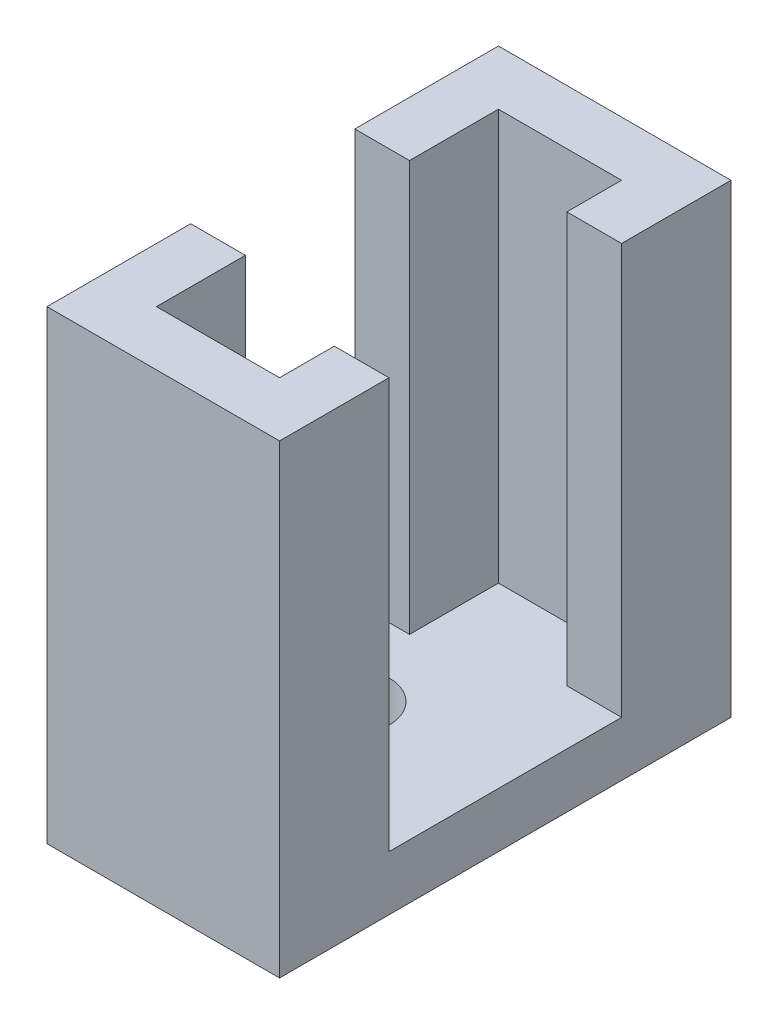
ISO-10303-21;
HEADER;
FILE_DESCRIPTION(('STEP AP214'),'2;1');
FILE_NAME('part.step','',(''),(''),'','','');
FILE_SCHEMA(('AUTOMOTIVE_DESIGN { 1 0 10303 214 1 1 1 1 }'));
ENDSEC;
DATA;
#1=APPLICATION_CONTEXT('core data for automotive mechanical design processes');
#2=APPLICATION_PROTOCOL_DEFINITION('international standard','automotive_design',2000,#1);
#3=PRODUCT_CONTEXT('',#1,'mechanical');
#4=PRODUCT('Part','Part','',(#3));
#5=PRODUCT_RELATED_PRODUCT_CATEGORY('part','',(#4));
#6=PRODUCT_DEFINITION_FORMATION('','',#4);
#7=PRODUCT_DEFINITION_CONTEXT('part definition',#1,'design');
#8=PRODUCT_DEFINITION('design','',#6,#7);
#9=PRODUCT_DEFINITION_SHAPE('','',#8);
#10=(LENGTH_UNIT() NAMED_UNIT(*) SI_UNIT(.MILLI.,.METRE.));
#11=(NAMED_UNIT(*) PLANE_ANGLE_UNIT() SI_UNIT($,.RADIAN.));
#12=(NAMED_UNIT(*) SI_UNIT($,.STERADIAN.) SOLID_ANGLE_UNIT());
#13=UNCERTAINTY_MEASURE_WITH_UNIT(LENGTH_MEASURE(1.E-05),#10,'distance_accuracy_value','');
#14=(GEOMETRIC_REPRESENTATION_CONTEXT(3) GLOBAL_UNCERTAINTY_ASSIGNED_CONTEXT((#13)) GLOBAL_UNIT_ASSIGNED_CONTEXT((#10,
#11,#12)) REPRESENTATION_CONTEXT('',''));
#15=CARTESIAN_POINT('',(0.,0.,0.));
#16=DIRECTION('',(0.,0.,1.));
#17=DIRECTION('',(1.,0.,0.));
#18=AXIS2_PLACEMENT_3D('',#15,#16,#17);
#19=CARTESIAN_POINT('',(-4.5,15.,0.));
#20=DIRECTION('',(-1.,0.,0.));
#21=DIRECTION('',(0.,0.,1.));
#22=AXIS2_PLACEMENT_3D('',#19,#20,#21);
#23=PLANE('',#22);
#24=DIRECTION('',(0.,0.,-1.));
#25=VECTOR('',#24,1.);
#26=CARTESIAN_POINT('',(-4.5,15.,0.));
#27=LINE('',#26,#25);
#28=CARTESIAN_POINT('',(-4.5,15.,3.25));
#29=VERTEX_POINT('',#28);
#30=CARTESIAN_POINT('',(-4.5,15.,0.));
#31=VERTEX_POINT('',#30);
#32=EDGE_CURVE('E53',#29,#31,#27,.T.);
#33=ORIENTED_EDGE('',*,*,#32,.F.);
#34=DIRECTION('',(0.,1.,0.));
#35=VECTOR('',#34,1.);
#36=CARTESIAN_POINT('',(-4.5,20.,3.25));
#37=LINE('',#36,#35);
#38=CARTESIAN_POINT('',(-4.5,0.,3.25));
#39=VERTEX_POINT('',#38);
#40=EDGE_CURVE('E180',#39,#29,#37,.T.);
#41=ORIENTED_EDGE('',*,*,#40,.F.);
#42=DIRECTION('',(0.,0.,-1.));
#43=VECTOR('',#42,1.);
#44=CARTESIAN_POINT('',(-4.5,0.,0.));
#45=LINE('',#44,#43);
#46=CARTESIAN_POINT('',(-4.5,0.,0.));
#47=VERTEX_POINT('',#46);
#48=EDGE_CURVE('E255',#39,#47,#45,.T.);
#49=ORIENTED_EDGE('',*,*,#48,.T.);
#50=DIRECTION('',(0.,-1.,0.));
#51=VECTOR('',#50,1.);
#52=CARTESIAN_POINT('',(-4.5,15.,0.));
#53=LINE('',#52,#51);
#54=EDGE_CURVE('E264',#31,#47,#53,.T.);
#55=ORIENTED_EDGE('',*,*,#54,.F.);
#56=EDGE_LOOP('',(#33,#41,#49,#55));
#57=FACE_BOUND('',#56,.T.);
#58=ADVANCED_FACE('F33',(#57),#23,.F.);
#59=CARTESIAN_POINT('',(0.,15.,0.));
#60=DIRECTION('',(0.,1.,0.));
#61=DIRECTION('',(0.,0.,1.));
#62=AXIS2_PLACEMENT_3D('',#59,#60,#61);
#63=PLANE('',#62);
#64=DIRECTION('',(-1.,0.,0.));
#65=VECTOR('',#64,1.);
#66=CARTESIAN_POINT('',(0.,15.,3.25));
#67=LINE('',#66,#65);
#68=CARTESIAN_POINT('',(-6.5,15.,3.25));
#69=VERTEX_POINT('',#68);
#70=EDGE_CURVE('E11',#29,#69,#67,.T.);
#71=ORIENTED_EDGE('',*,*,#70,.F.);
#72=ORIENTED_EDGE('',*,*,#32,.T.);
#73=DIRECTION('',(1.,0.,0.));
#74=VECTOR('',#73,1.);
#75=CARTESIAN_POINT('',(0.,15.,0.));
#76=LINE('',#75,#74);
#77=CARTESIAN_POINT('',(0.,15.,0.));
#78=VERTEX_POINT('',#77);
#79=EDGE_CURVE('E48',#31,#78,#76,.T.);
#80=ORIENTED_EDGE('',*,*,#79,.T.);
#81=DIRECTION('',(0.,0.,1.));
#82=VECTOR('',#81,1.);
#83=CARTESIAN_POINT('',(0.,15.,2.));
#84=LINE('',#83,#82);
#85=CARTESIAN_POINT('',(0.,15.,2.));
#86=VERTEX_POINT('',#85);
#87=EDGE_CURVE('E213',#78,#86,#84,.T.);
#88=ORIENTED_EDGE('',*,*,#87,.T.);
#89=DIRECTION('',(1.,0.,0.));
#90=VECTOR('',#89,1.);
#91=CARTESIAN_POINT('',(2.,15.,2.));
#92=LINE('',#91,#90);
#93=CARTESIAN_POINT('',(2.,15.,2.));
#94=VERTEX_POINT('',#93);
#95=EDGE_CURVE('E215',#86,#94,#92,.T.);
#96=ORIENTED_EDGE('',*,*,#95,.T.);
#97=DIRECTION('',(0.,0.,-1.));
#98=VECTOR('',#97,1.);
#99=CARTESIAN_POINT('',(2.,15.,-2.));
#100=LINE('',#99,#98);
#101=CARTESIAN_POINT('',(2.,15.,-2.));
#102=VERTEX_POINT('',#101);
#103=EDGE_CURVE('E218',#94,#102,#100,.T.);
#104=ORIENTED_EDGE('',*,*,#103,.T.);
#105=DIRECTION('',(-1.,0.,0.));
#106=VECTOR('',#105,1.);
#107=CARTESIAN_POINT('',(-6.5,15.,-2.));
#108=LINE('',#107,#106);
#109=CARTESIAN_POINT('',(-6.5,15.,-2.));
#110=VERTEX_POINT('',#109);
#111=EDGE_CURVE('E220',#102,#110,#108,.T.);
#112=ORIENTED_EDGE('',*,*,#111,.T.);
#113=DIRECTION('',(0.,0.,1.));
#114=VECTOR('',#113,1.);
#115=CARTESIAN_POINT('',(-6.5,15.,14.5));
#116=LINE('',#115,#114);
#117=EDGE_CURVE('E222',#110,#69,#116,.T.);
#118=ORIENTED_EDGE('',*,*,#117,.T.);
#119=EDGE_LOOP('',(#71,#72,#80,#88,#96,#104,#112,#118));
#120=FACE_BOUND('',#119,.T.);
#121=ADVANCED_FACE('F332',(#120),#63,.T.);
#122=CARTESIAN_POINT('',(0.,15.,2.));
#123=DIRECTION('',(1.,0.,0.));
#124=DIRECTION('',(0.,0.,-1.));
#125=AXIS2_PLACEMENT_3D('',#122,#123,#124);
#126=PLANE('',#125);
#127=DIRECTION('',(0.,0.,1.));
#128=VECTOR('',#127,1.);
#129=CARTESIAN_POINT('',(0.,0.,2.));
#130=LINE('',#129,#128);
#131=CARTESIAN_POINT('',(0.,0.,0.));
#132=VERTEX_POINT('',#131);
#133=CARTESIAN_POINT('',(0.,0.,2.));
#134=VERTEX_POINT('',#133);
#135=EDGE_CURVE('E210',#132,#134,#130,.T.);
#136=ORIENTED_EDGE('',*,*,#135,.T.);
#137=DIRECTION('',(0.,-1.,0.));
#138=VECTOR('',#137,1.);
#139=CARTESIAN_POINT('',(0.,15.,2.));
#140=LINE('',#139,#138);
#141=EDGE_CURVE('E290',#86,#134,#140,.T.);
#142=ORIENTED_EDGE('',*,*,#141,.F.);
#143=ORIENTED_EDGE('',*,*,#87,.F.);
#144=DIRECTION('',(0.,-1.,0.));
#145=VECTOR('',#144,1.);
#146=CARTESIAN_POINT('',(0.,15.,0.));
#147=LINE('',#146,#145);
#148=EDGE_CURVE('E239',#78,#132,#147,.T.);
#149=ORIENTED_EDGE('',*,*,#148,.T.);
#150=EDGE_LOOP('',(#136,#142,#143,#149));
#151=FACE_BOUND('',#150,.T.);
#152=ADVANCED_FACE('F35',(#151),#126,.F.);
#153=CARTESIAN_POINT('',(2.,15.,2.));
#154=DIRECTION('',(0.,0.,-1.));
#155=DIRECTION('',(-1.,0.,0.));
#156=AXIS2_PLACEMENT_3D('',#153,#154,#155);
#157=PLANE('',#156);
#158=DIRECTION('',(1.,0.,0.));
#159=VECTOR('',#158,1.);
#160=CARTESIAN_POINT('',(2.,0.,2.));
#161=LINE('',#160,#159);
#162=CARTESIAN_POINT('',(2.,0.,2.));
#163=VERTEX_POINT('',#162);
#164=EDGE_CURVE('E242',#134,#163,#161,.T.);
#165=ORIENTED_EDGE('',*,*,#164,.T.);
#166=DIRECTION('',(0.,-1.,0.));
#167=VECTOR('',#166,1.);
#168=CARTESIAN_POINT('',(2.,15.,2.));
#169=LINE('',#168,#167);
#170=EDGE_CURVE('E287',#94,#163,#169,.T.);
#171=ORIENTED_EDGE('',*,*,#170,.F.);
#172=ORIENTED_EDGE('',*,*,#95,.F.);
#173=ORIENTED_EDGE('',*,*,#141,.T.);
#174=EDGE_LOOP('',(#165,#171,#172,#173));
#175=FACE_BOUND('',#174,.T.);
#176=ADVANCED_FACE('F325',(#175),#157,.F.);
#177=CARTESIAN_POINT('',(-6.5,15.,-2.));
#178=DIRECTION('',(0.,0.,1.));
#179=DIRECTION('',(1.,0.,0.));
#180=AXIS2_PLACEMENT_3D('',#177,#178,#179);
#181=PLANE('',#180);
#182=DIRECTION('',(0.,-1.,0.));
#183=VECTOR('',#182,1.);
#184=CARTESIAN_POINT('',(2.,15.,-2.));
#185=LINE('',#184,#183);
#186=CARTESIAN_POINT('',(2.,-2.,-2.));
#187=VERTEX_POINT('',#186);
#188=EDGE_CURVE('E285',#102,#187,#185,.T.);
#189=ORIENTED_EDGE('',*,*,#188,.T.);
#190=DIRECTION('',(1.,0.,0.));
#191=VECTOR('',#190,1.);
#192=CARTESIAN_POINT('',(-6.5,-2.,-2.));
#193=LINE('',#192,#191);
#194=CARTESIAN_POINT('',(-6.5,-2.,-2.));
#195=VERTEX_POINT('',#194);
#196=EDGE_CURVE('E201',#195,#187,#193,.T.);
#197=ORIENTED_EDGE('',*,*,#196,.F.);
#198=DIRECTION('',(0.,-1.,0.));
#199=VECTOR('',#198,1.);
#200=CARTESIAN_POINT('',(-6.5,15.,-2.));
#201=LINE('',#200,#199);
#202=EDGE_CURVE('E283',#110,#195,#201,.T.);
#203=ORIENTED_EDGE('',*,*,#202,.F.);
#204=ORIENTED_EDGE('',*,*,#111,.F.);
#205=EDGE_LOOP('',(#189,#197,#203,#204));
#206=FACE_BOUND('',#205,.T.);
#207=ADVANCED_FACE('F338',(#206),#181,.F.);
#208=CARTESIAN_POINT('',(-6.5,15.,14.5));
#209=DIRECTION('',(1.,0.,0.));
#210=DIRECTION('',(0.,0.,-1.));
#211=AXIS2_PLACEMENT_3D('',#208,#209,#210);
#212=PLANE('',#211);
#213=DIRECTION('',(0.,0.,-1.));
#214=VECTOR('',#213,1.);
#215=CARTESIAN_POINT('',(-6.5,0.,9.25));
#216=LINE('',#215,#214);
#217=CARTESIAN_POINT('',(-6.5,0.,9.25));
#218=VERTEX_POINT('',#217);
#219=CARTESIAN_POINT('',(-6.5,0.,3.25));
#220=VERTEX_POINT('',#219);
#221=EDGE_CURVE('E162',#218,#220,#216,.T.);
#222=ORIENTED_EDGE('',*,*,#221,.T.);
#223=DIRECTION('',(0.,1.,0.));
#224=VECTOR('',#223,1.);
#225=CARTESIAN_POINT('',(-6.5,20.,3.25));
#226=LINE('',#225,#224);
#227=EDGE_CURVE('E176',#220,#69,#226,.T.);
#228=ORIENTED_EDGE('',*,*,#227,.T.);
#229=ORIENTED_EDGE('',*,*,#117,.F.);
#230=ORIENTED_EDGE('',*,*,#202,.T.);
#231=DIRECTION('',(0.,0.,-1.));
#232=VECTOR('',#231,1.);
#233=CARTESIAN_POINT('',(-6.5,-2.,14.5));
#234=LINE('',#233,#232);
#235=CARTESIAN_POINT('',(-6.5,-2.,14.5));
#236=VERTEX_POINT('',#235);
#237=EDGE_CURVE('E198',#236,#195,#234,.T.);
#238=ORIENTED_EDGE('',*,*,#237,.F.);
#239=DIRECTION('',(0.,-1.,0.));
#240=VECTOR('',#239,1.);
#241=CARTESIAN_POINT('',(-6.5,15.,14.5));
#242=LINE('',#241,#240);
#243=CARTESIAN_POINT('',(-6.5,15.,14.5));
#244=VERTEX_POINT('',#243);
#245=EDGE_CURVE('E281',#244,#236,#242,.T.);
#246=ORIENTED_EDGE('',*,*,#245,.F.);
#247=CARTESIAN_POINT('',(-6.5,15.,9.25));
#248=VERTEX_POINT('',#247);
#249=EDGE_CURVE('E175',#248,#244,#116,.T.);
#250=ORIENTED_EDGE('',*,*,#249,.F.);
#251=DIRECTION('',(0.,-1.,0.));
#252=VECTOR('',#251,1.);
#253=CARTESIAN_POINT('',(-6.5,20.,9.25));
#254=LINE('',#253,#252);
#255=EDGE_CURVE('E155',#248,#218,#254,.T.);
#256=ORIENTED_EDGE('',*,*,#255,.T.);
#257=EDGE_LOOP('',(#222,#228,#229,#230,#238,#246,#250,#256));
#258=FACE_BOUND('',#257,.T.);
#259=ADVANCED_FACE('F173',(#258),#212,.F.);
#260=CARTESIAN_POINT('',(2.,15.,14.5));
#261=DIRECTION('',(0.,0.,-1.));
#262=DIRECTION('',(-1.,0.,0.));
#263=AXIS2_PLACEMENT_3D('',#260,#261,#262);
#264=PLANE('',#263);
#265=ORIENTED_EDGE('',*,*,#245,.T.);
#266=DIRECTION('',(-1.,0.,0.));
#267=VECTOR('',#266,1.);
#268=CARTESIAN_POINT('',(-6.5,-2.,14.5));
#269=LINE('',#268,#267);
#270=CARTESIAN_POINT('',(2.,-2.,14.5));
#271=VERTEX_POINT('',#270);
#272=EDGE_CURVE('E207',#271,#236,#269,.T.);
#273=ORIENTED_EDGE('',*,*,#272,.F.);
#274=DIRECTION('',(0.,-1.,0.));
#275=VECTOR('',#274,1.);
#276=CARTESIAN_POINT('',(2.,15.,14.5));
#277=LINE('',#276,#275);
#278=CARTESIAN_POINT('',(2.,15.,14.5));
#279=VERTEX_POINT('',#278);
#280=EDGE_CURVE('E279',#279,#271,#277,.T.);
#281=ORIENTED_EDGE('',*,*,#280,.F.);
#282=DIRECTION('',(1.,0.,0.));
#283=VECTOR('',#282,1.);
#284=CARTESIAN_POINT('',(2.,15.,14.5));
#285=LINE('',#284,#283);
#286=EDGE_CURVE('E225',#244,#279,#285,.T.);
#287=ORIENTED_EDGE('',*,*,#286,.F.);
#288=EDGE_LOOP('',(#265,#273,#281,#287));
#289=FACE_BOUND('',#288,.T.);
#290=ADVANCED_FACE('F377',(#289),#264,.F.);
#291=CARTESIAN_POINT('',(2.,15.,10.5));
#292=DIRECTION('',(-1.,0.,0.));
#293=DIRECTION('',(0.,0.,1.));
#294=AXIS2_PLACEMENT_3D('',#291,#292,#293);
#295=PLANE('',#294);
#296=ORIENTED_EDGE('',*,*,#280,.T.);
#297=DIRECTION('',(0.,0.,1.));
#298=VECTOR('',#297,1.);
#299=CARTESIAN_POINT('',(2.,-2.,14.5));
#300=LINE('',#299,#298);
#301=EDGE_CURVE('E204',#187,#271,#300,.T.);
#302=ORIENTED_EDGE('',*,*,#301,.F.);
#303=ORIENTED_EDGE('',*,*,#188,.F.);
#304=ORIENTED_EDGE('',*,*,#103,.F.);
#305=ORIENTED_EDGE('',*,*,#170,.T.);
#306=DIRECTION('',(0.,0.,1.));
#307=VECTOR('',#306,1.);
#308=CARTESIAN_POINT('',(2.,0.,14.5));
#309=LINE('',#308,#307);
#310=CARTESIAN_POINT('',(2.,0.,10.5));
#311=VERTEX_POINT('',#310);
#312=EDGE_CURVE('E194',#163,#311,#309,.T.);
#313=ORIENTED_EDGE('',*,*,#312,.T.);
#314=DIRECTION('',(0.,-1.,0.));
#315=VECTOR('',#314,1.);
#316=CARTESIAN_POINT('',(2.,15.,10.5));
#317=LINE('',#316,#315);
#318=CARTESIAN_POINT('',(2.,15.,10.5));
#319=VERTEX_POINT('',#318);
#320=EDGE_CURVE('E276',#319,#311,#317,.T.);
#321=ORIENTED_EDGE('',*,*,#320,.F.);
#322=DIRECTION('',(0.,0.,-1.));
#323=VECTOR('',#322,1.);
#324=CARTESIAN_POINT('',(2.,15.,10.5));
#325=LINE('',#324,#323);
#326=EDGE_CURVE('E227',#279,#319,#325,.T.);
#327=ORIENTED_EDGE('',*,*,#326,.F.);
#328=EDGE_LOOP('',(#296,#302,#303,#304,#305,#313,#321,#327));
#329=FACE_BOUND('',#328,.T.);
#330=ADVANCED_FACE('F319',(#329),#295,.F.);
#331=CARTESIAN_POINT('',(0.,15.,10.5));
#332=DIRECTION('',(0.,0.,1.));
#333=DIRECTION('',(1.,0.,0.));
#334=AXIS2_PLACEMENT_3D('',#331,#332,#333);
#335=PLANE('',#334);
#336=DIRECTION('',(-1.,0.,0.));
#337=VECTOR('',#336,1.);
#338=CARTESIAN_POINT('',(0.,0.,10.5));
#339=LINE('',#338,#337);
#340=CARTESIAN_POINT('',(0.,0.,10.5));
#341=VERTEX_POINT('',#340);
#342=EDGE_CURVE('E245',#311,#341,#339,.T.);
#343=ORIENTED_EDGE('',*,*,#342,.T.);
#344=DIRECTION('',(0.,-1.,0.));
#345=VECTOR('',#344,1.);
#346=CARTESIAN_POINT('',(0.,15.,10.5));
#347=LINE('',#346,#345);
#348=CARTESIAN_POINT('',(0.,15.,10.5));
#349=VERTEX_POINT('',#348);
#350=EDGE_CURVE('E273',#349,#341,#347,.T.);
#351=ORIENTED_EDGE('',*,*,#350,.F.);
#352=DIRECTION('',(-1.,0.,0.));
#353=VECTOR('',#352,1.);
#354=CARTESIAN_POINT('',(0.,15.,10.5));
#355=LINE('',#354,#353);
#356=EDGE_CURVE('E229',#319,#349,#355,.T.);
#357=ORIENTED_EDGE('',*,*,#356,.F.);
#358=ORIENTED_EDGE('',*,*,#320,.T.);
#359=EDGE_LOOP('',(#343,#351,#357,#358));
#360=FACE_BOUND('',#359,.T.);
#361=ADVANCED_FACE('F316',(#360),#335,.F.);
#362=CARTESIAN_POINT('',(0.,15.,12.5));
#363=DIRECTION('',(1.,0.,0.));
#364=DIRECTION('',(0.,0.,-1.));
#365=AXIS2_PLACEMENT_3D('',#362,#363,#364);
#366=PLANE('',#365);
#367=DIRECTION('',(0.,0.,1.));
#368=VECTOR('',#367,1.);
#369=CARTESIAN_POINT('',(0.,0.,12.5));
#370=LINE('',#369,#368);
#371=CARTESIAN_POINT('',(0.,0.,12.5));
#372=VERTEX_POINT('',#371);
#373=EDGE_CURVE('E248',#341,#372,#370,.T.);
#374=ORIENTED_EDGE('',*,*,#373,.T.);
#375=DIRECTION('',(0.,-1.,0.));
#376=VECTOR('',#375,1.);
#377=CARTESIAN_POINT('',(0.,15.,12.5));
#378=LINE('',#377,#376);
#379=CARTESIAN_POINT('',(0.,15.,12.5));
#380=VERTEX_POINT('',#379);
#381=EDGE_CURVE('E270',#380,#372,#378,.T.);
#382=ORIENTED_EDGE('',*,*,#381,.F.);
#383=DIRECTION('',(0.,0.,1.));
#384=VECTOR('',#383,1.);
#385=CARTESIAN_POINT('',(0.,15.,12.5));
#386=LINE('',#385,#384);
#387=EDGE_CURVE('E231',#349,#380,#386,.T.);
#388=ORIENTED_EDGE('',*,*,#387,.F.);
#389=ORIENTED_EDGE('',*,*,#350,.T.);
#390=EDGE_LOOP('',(#374,#382,#388,#389));
#391=FACE_BOUND('',#390,.T.);
#392=ADVANCED_FACE('F312',(#391),#366,.F.);
#393=CARTESIAN_POINT('',(-4.5,15.,12.5));
#394=DIRECTION('',(0.,0.,1.));
#395=DIRECTION('',(1.,0.,0.));
#396=AXIS2_PLACEMENT_3D('',#393,#394,#395);
#397=PLANE('',#396);
#398=DIRECTION('',(-1.,0.,0.));
#399=VECTOR('',#398,1.);
#400=CARTESIAN_POINT('',(-4.5,0.,12.5));
#401=LINE('',#400,#399);
#402=CARTESIAN_POINT('',(-3.5,0.,12.5));
#403=VERTEX_POINT('',#402);
#404=EDGE_CURVE('E252',#372,#403,#401,.T.);
#405=ORIENTED_EDGE('',*,*,#404,.T.);
#406=CARTESIAN_POINT('',(-4.5,0.,12.5));
#407=VERTEX_POINT('',#406);
#408=EDGE_CURVE('E251',#403,#407,#401,.T.);
#409=ORIENTED_EDGE('',*,*,#408,.T.);
#410=DIRECTION('',(0.,-1.,0.));
#411=VECTOR('',#410,1.);
#412=CARTESIAN_POINT('',(-4.5,15.,12.5));
#413=LINE('',#412,#411);
#414=CARTESIAN_POINT('',(-4.5,15.,12.5));
#415=VERTEX_POINT('',#414);
#416=EDGE_CURVE('E267',#415,#407,#413,.T.);
#417=ORIENTED_EDGE('',*,*,#416,.F.);
#418=DIRECTION('',(-1.,0.,0.));
#419=VECTOR('',#418,1.);
#420=CARTESIAN_POINT('',(-4.5,15.,12.5));
#421=LINE('',#420,#419);
#422=EDGE_CURVE('E233',#380,#415,#421,.T.);
#423=ORIENTED_EDGE('',*,*,#422,.F.);
#424=ORIENTED_EDGE('',*,*,#381,.T.);
#425=EDGE_LOOP('',(#405,#409,#417,#423,#424));
#426=FACE_BOUND('',#425,.T.);
#427=ADVANCED_FACE('F303',(#426),#397,.F.);
#428=CARTESIAN_POINT('',(-4.5,0.,11.5));
#429=VERTEX_POINT('',#428);
#430=CARTESIAN_POINT('',(-4.5,0.,9.25));
#431=VERTEX_POINT('',#430);
#432=EDGE_CURVE('E259',#429,#431,#45,.T.);
#433=ORIENTED_EDGE('',*,*,#432,.T.);
#434=DIRECTION('',(0.,-1.,0.));
#435=VECTOR('',#434,1.);
#436=CARTESIAN_POINT('',(-4.5,20.,9.25));
#437=LINE('',#436,#435);
#438=CARTESIAN_POINT('',(-4.5,15.,9.25));
#439=VERTEX_POINT('',#438);
#440=EDGE_CURVE('E158',#439,#431,#437,.T.);
#441=ORIENTED_EDGE('',*,*,#440,.F.);
#442=EDGE_CURVE('E235',#415,#439,#27,.T.);
#443=ORIENTED_EDGE('',*,*,#442,.F.);
#444=ORIENTED_EDGE('',*,*,#416,.T.);
#445=EDGE_CURVE('E256',#407,#429,#45,.T.);
#446=ORIENTED_EDGE('',*,*,#445,.T.);
#447=EDGE_LOOP('',(#433,#441,#443,#444,#446));
#448=FACE_BOUND('',#447,.T.);
#449=ADVANCED_FACE('F295',(#448),#23,.F.);
#450=CARTESIAN_POINT('',(0.,15.,0.));
#451=DIRECTION('',(0.,0.,-1.));
#452=DIRECTION('',(-1.,0.,0.));
#453=AXIS2_PLACEMENT_3D('',#450,#451,#452);
#454=PLANE('',#453);
#455=DIRECTION('',(1.,0.,0.));
#456=VECTOR('',#455,1.);
#457=CARTESIAN_POINT('',(0.,0.,0.));
#458=LINE('',#457,#456);
#459=EDGE_CURVE('E216',#47,#132,#458,.T.);
#460=ORIENTED_EDGE('',*,*,#459,.T.);
#461=ORIENTED_EDGE('',*,*,#148,.F.);
#462=ORIENTED_EDGE('',*,*,#79,.F.);
#463=ORIENTED_EDGE('',*,*,#54,.T.);
#464=EDGE_LOOP('',(#460,#461,#462,#463));
#465=FACE_BOUND('',#464,.T.);
#466=ADVANCED_FACE('F330',(#465),#454,.F.);
#467=DIRECTION('',(1.,0.,0.));
#468=VECTOR('',#467,1.);
#469=CARTESIAN_POINT('',(0.,15.,9.25));
#470=LINE('',#469,#468);
#471=EDGE_CURVE('E41',#248,#439,#470,.T.);
#472=ORIENTED_EDGE('',*,*,#471,.F.);
#473=ORIENTED_EDGE('',*,*,#249,.T.);
#474=ORIENTED_EDGE('',*,*,#286,.T.);
#475=ORIENTED_EDGE('',*,*,#326,.T.);
#476=ORIENTED_EDGE('',*,*,#356,.T.);
#477=ORIENTED_EDGE('',*,*,#387,.T.);
#478=ORIENTED_EDGE('',*,*,#422,.T.);
#479=ORIENTED_EDGE('',*,*,#442,.T.);
#480=EDGE_LOOP('',(#472,#473,#474,#475,#476,#477,#478,#479));
#481=FACE_BOUND('',#480,.T.);
#482=ADVANCED_FACE('F296',(#481),#63,.T.);
#483=CARTESIAN_POINT('',(0.,0.,0.));
#484=DIRECTION('',(0.,-1.,0.));
#485=DIRECTION('',(0.,0.,-1.));
#486=AXIS2_PLACEMENT_3D('',#483,#484,#485);
#487=PLANE('',#486);
#488=ORIENTED_EDGE('',*,*,#48,.F.);
#489=DIRECTION('',(1.,0.,0.));
#490=VECTOR('',#489,1.);
#491=CARTESIAN_POINT('',(-6.5,0.,3.25));
#492=LINE('',#491,#490);
#493=EDGE_CURVE('E161',#220,#39,#492,.T.);
#494=ORIENTED_EDGE('',*,*,#493,.F.);
#495=ORIENTED_EDGE('',*,*,#221,.F.);
#496=DIRECTION('',(1.,0.,0.));
#497=VECTOR('',#496,1.);
#498=CARTESIAN_POINT('',(-6.5,0.,9.25));
#499=LINE('',#498,#497);
#500=EDGE_CURVE('E151',#218,#431,#499,.T.);
#501=ORIENTED_EDGE('',*,*,#500,.T.);
#502=ORIENTED_EDGE('',*,*,#432,.F.);
#503=CARTESIAN_POINT('',(-3.5,0.,11.5));
#504=DIRECTION('',(0.,-1.,0.));
#505=DIRECTION('',(0.,0.,-1.));
#506=AXIS2_PLACEMENT_3D('',#503,#504,#505);
#507=CIRCLE('',#506,1.);
#508=EDGE_CURVE('E188',#429,#403,#507,.T.);
#509=ORIENTED_EDGE('',*,*,#508,.T.);
#510=ORIENTED_EDGE('',*,*,#404,.F.);
#511=ORIENTED_EDGE('',*,*,#373,.F.);
#512=ORIENTED_EDGE('',*,*,#342,.F.);
#513=ORIENTED_EDGE('',*,*,#312,.F.);
#514=ORIENTED_EDGE('',*,*,#164,.F.);
#515=ORIENTED_EDGE('',*,*,#135,.F.);
#516=ORIENTED_EDGE('',*,*,#459,.F.);
#517=EDGE_LOOP('',(#488,#494,#495,#501,#502,#509,#510,#511,#512,#513,#514,#515,#516));
#518=FACE_BOUND('',#517,.T.);
#519=CARTESIAN_POINT('',(-3.5,0.,6.5));
#520=DIRECTION('',(0.,-1.,0.));
#521=DIRECTION('',(0.,0.,-1.));
#522=AXIS2_PLACEMENT_3D('',#519,#520,#521);
#523=CIRCLE('',#522,1.5);
#524=CARTESIAN_POINT('',(-3.5,0.,5.));
#525=VERTEX_POINT('',#524);
#526=EDGE_CURVE('E183',#525,#525,#523,.T.);
#527=ORIENTED_EDGE('',*,*,#526,.T.);
#528=EDGE_LOOP('',(#527));
#529=FACE_BOUND('',#528,.T.);
#530=ADVANCED_FACE('F166',(#518,#529),#487,.F.);
#531=CARTESIAN_POINT('',(0.,-2.,0.));
#532=DIRECTION('',(0.,-1.,0.));
#533=DIRECTION('',(0.,0.,-1.));
#534=AXIS2_PLACEMENT_3D('',#531,#532,#533);
#535=PLANE('',#534);
#536=CARTESIAN_POINT('',(-3.5,-2.,11.5));
#537=DIRECTION('',(0.,-1.,0.));
#538=DIRECTION('',(0.,0.,-1.));
#539=AXIS2_PLACEMENT_3D('',#536,#537,#538);
#540=CIRCLE('',#539,1.);
#541=CARTESIAN_POINT('',(-3.5,-2.,10.5));
#542=VERTEX_POINT('',#541);
#543=EDGE_CURVE('E191',#542,#542,#540,.T.);
#544=ORIENTED_EDGE('',*,*,#543,.F.);
#545=EDGE_LOOP('',(#544));
#546=FACE_BOUND('',#545,.T.);
#547=ORIENTED_EDGE('',*,*,#237,.T.);
#548=ORIENTED_EDGE('',*,*,#196,.T.);
#549=ORIENTED_EDGE('',*,*,#301,.T.);
#550=ORIENTED_EDGE('',*,*,#272,.T.);
#551=EDGE_LOOP('',(#547,#548,#549,#550));
#552=FACE_BOUND('',#551,.T.);
#553=CARTESIAN_POINT('',(-3.5,-2.,6.5));
#554=DIRECTION('',(0.,-1.,0.));
#555=DIRECTION('',(0.,0.,-1.));
#556=AXIS2_PLACEMENT_3D('',#553,#554,#555);
#557=CIRCLE('',#556,1.5);
#558=CARTESIAN_POINT('',(-3.5,-2.,5.));
#559=VERTEX_POINT('',#558);
#560=EDGE_CURVE('E185',#559,#559,#557,.T.);
#561=ORIENTED_EDGE('',*,*,#560,.F.);
#562=EDGE_LOOP('',(#561));
#563=FACE_BOUND('',#562,.T.);
#564=ADVANCED_FACE('F430',(#546,#552,#563),#535,.T.);
#565=ORIENTED_EDGE('',*,*,#445,.F.);
#566=ORIENTED_EDGE('',*,*,#408,.F.);
#567=EDGE_CURVE('E195',#403,#429,#507,.T.);
#568=ORIENTED_EDGE('',*,*,#567,.T.);
#569=EDGE_LOOP('',(#565,#566,#568));
#570=FACE_BOUND('',#569,.T.);
#571=ADVANCED_FACE('F305',(#570),#487,.F.);
#572=CARTESIAN_POINT('',(-3.5,-2.,11.5));
#573=DIRECTION('',(0.,1.,0.));
#574=DIRECTION('',(0.,0.,1.));
#575=AXIS2_PLACEMENT_3D('',#572,#573,#574);
#576=CYLINDRICAL_SURFACE('',#575,1.);
#577=ORIENTED_EDGE('',*,*,#543,.T.);
#578=EDGE_LOOP('',(#577));
#579=FACE_BOUND('',#578,.T.);
#580=ORIENTED_EDGE('',*,*,#567,.F.);
#581=ORIENTED_EDGE('',*,*,#508,.F.);
#582=EDGE_LOOP('',(#580,#581));
#583=FACE_BOUND('',#582,.T.);
#584=ADVANCED_FACE('F310',(#579,#583),#576,.F.);
#585=CARTESIAN_POINT('',(-3.5,-2.,6.5));
#586=DIRECTION('',(0.,1.,0.));
#587=DIRECTION('',(0.,0.,1.));
#588=AXIS2_PLACEMENT_3D('',#585,#586,#587);
#589=CYLINDRICAL_SURFACE('',#588,1.5);
#590=ORIENTED_EDGE('',*,*,#560,.T.);
#591=EDGE_LOOP('',(#590));
#592=FACE_BOUND('',#591,.T.);
#593=ORIENTED_EDGE('',*,*,#526,.F.);
#594=EDGE_LOOP('',(#593));
#595=FACE_BOUND('',#594,.T.);
#596=ADVANCED_FACE('F346',(#592,#595),#589,.F.);
#597=CARTESIAN_POINT('',(-6.5,20.,3.25));
#598=DIRECTION('',(0.,0.,-1.));
#599=DIRECTION('',(-1.,0.,0.));
#600=AXIS2_PLACEMENT_3D('',#597,#598,#599);
#601=PLANE('',#600);
#602=ORIENTED_EDGE('',*,*,#70,.T.);
#603=ORIENTED_EDGE('',*,*,#227,.F.);
#604=ORIENTED_EDGE('',*,*,#493,.T.);
#605=ORIENTED_EDGE('',*,*,#40,.T.);
#606=EDGE_LOOP('',(#602,#603,#604,#605));
#607=FACE_BOUND('',#606,.T.);
#608=ADVANCED_FACE('F344',(#607),#601,.F.);
#609=CARTESIAN_POINT('',(-6.5,20.,9.25));
#610=DIRECTION('',(0.,0.,1.));
#611=DIRECTION('',(0.,-1.,0.));
#612=AXIS2_PLACEMENT_3D('',#609,#610,#611);
#613=PLANE('',#612);
#614=ORIENTED_EDGE('',*,*,#471,.T.);
#615=ORIENTED_EDGE('',*,*,#440,.T.);
#616=ORIENTED_EDGE('',*,*,#500,.F.);
#617=ORIENTED_EDGE('',*,*,#255,.F.);
#618=EDGE_LOOP('',(#614,#615,#616,#617));
#619=FACE_BOUND('',#618,.T.);
#620=ADVANCED_FACE('F153',(#619),#613,.F.);
#621=CLOSED_SHELL('',(#58,#121,#152,#176,#207,#259,#290,#330,#361,#392,#427,#449,#466,#482,#530,
#564,#571,#584,#596,#608,#620));
#622=MANIFOLD_SOLID_BREP('B2',#621);
#623=ADVANCED_BREP_SHAPE_REPRESENTATION('',(#18,#622),#14);
#624=SHAPE_DEFINITION_REPRESENTATION(#9,#623);
ENDSEC;
END-ISO-10303-21;
